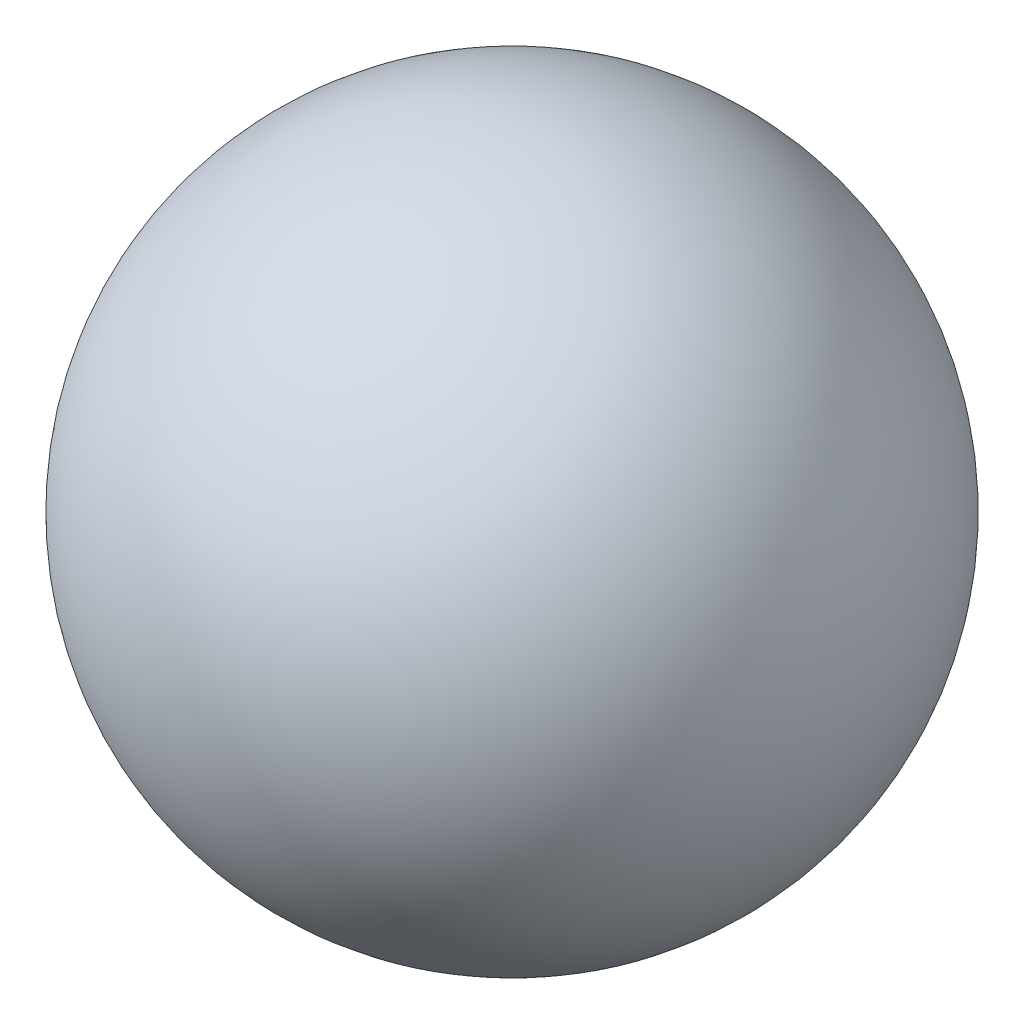
ISO-10303-21;
HEADER;
FILE_DESCRIPTION(('STEP AP214'),'2;1');
FILE_NAME('part.step','',(''),(''),'','','');
FILE_SCHEMA(('AUTOMOTIVE_DESIGN { 1 0 10303 214 1 1 1 1 }'));
ENDSEC;
DATA;
#1=APPLICATION_CONTEXT('core data for automotive mechanical design processes');
#2=APPLICATION_PROTOCOL_DEFINITION('international standard','automotive_design',2000,#1);
#3=PRODUCT_CONTEXT('',#1,'mechanical');
#4=PRODUCT('Part','Part','',(#3));
#5=PRODUCT_RELATED_PRODUCT_CATEGORY('part','',(#4));
#6=PRODUCT_DEFINITION_FORMATION('','',#4);
#7=PRODUCT_DEFINITION_CONTEXT('part definition',#1,'design');
#8=PRODUCT_DEFINITION('design','',#6,#7);
#9=PRODUCT_DEFINITION_SHAPE('','',#8);
#10=(LENGTH_UNIT() NAMED_UNIT(*) SI_UNIT(.MILLI.,.METRE.));
#11=(NAMED_UNIT(*) PLANE_ANGLE_UNIT() SI_UNIT($,.RADIAN.));
#12=(NAMED_UNIT(*) SI_UNIT($,.STERADIAN.) SOLID_ANGLE_UNIT());
#13=UNCERTAINTY_MEASURE_WITH_UNIT(LENGTH_MEASURE(1.E-05),#10,'distance_accuracy_value','');
#14=(GEOMETRIC_REPRESENTATION_CONTEXT(3) GLOBAL_UNCERTAINTY_ASSIGNED_CONTEXT((#13)) GLOBAL_UNIT_ASSIGNED_CONTEXT((#10,
#11,#12)) REPRESENTATION_CONTEXT('',''));
#15=CARTESIAN_POINT('',(0.,0.,0.));
#16=DIRECTION('',(0.,0.,1.));
#17=DIRECTION('',(1.,0.,0.));
#18=AXIS2_PLACEMENT_3D('',#15,#16,#17);
#19=CARTESIAN_POINT('',(0.,0.,0.));
#20=DIRECTION('',(0.,1.,0.));
#21=DIRECTION('',(1.,0.,0.));
#22=AXIS2_PLACEMENT_3D('',#19,#20,#21);
#23=SPHERICAL_SURFACE('',#22,12.7);
#24=CARTESIAN_POINT('',(0.,12.7,0.));
#25=VERTEX_POINT('',#24);
#26=VERTEX_LOOP('',#25);
#27=FACE_BOUND('',#26,.T.);
#28=ADVANCED_FACE('F29',(#27),#23,.T.);
#29=CLOSED_SHELL('',(#28));
#30=MANIFOLD_SOLID_BREP('B2',#29);
#31=ADVANCED_BREP_SHAPE_REPRESENTATION('',(#18,#30),#14);
#32=SHAPE_DEFINITION_REPRESENTATION(#9,#31);
ENDSEC;
END-ISO-10303-21;
